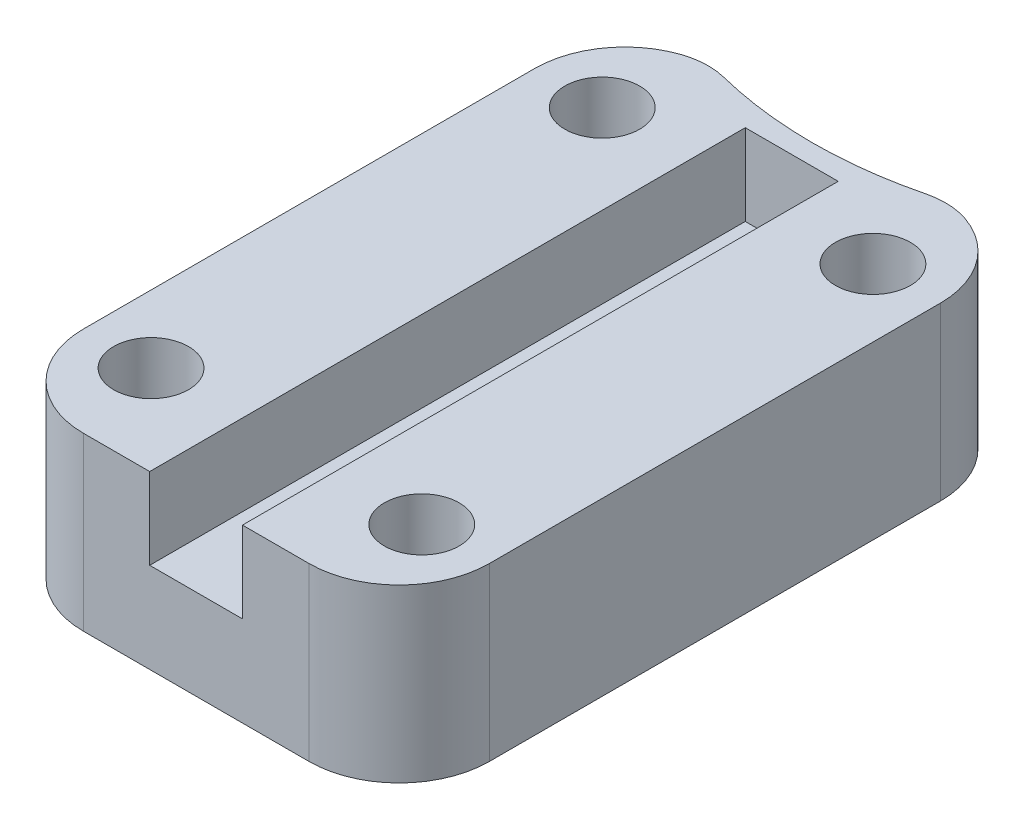
ISO-10303-21;
HEADER;
FILE_DESCRIPTION(('STEP AP214'),'2;1');
FILE_NAME('part.step','',(''),(''),'','','');
FILE_SCHEMA(('AUTOMOTIVE_DESIGN { 1 0 10303 214 1 1 1 1 }'));
ENDSEC;
DATA;
#1=APPLICATION_CONTEXT('core data for automotive mechanical design processes');
#2=APPLICATION_PROTOCOL_DEFINITION('international standard','automotive_design',2000,#1);
#3=PRODUCT_CONTEXT('',#1,'mechanical');
#4=PRODUCT('Part','Part','',(#3));
#5=PRODUCT_RELATED_PRODUCT_CATEGORY('part','',(#4));
#6=PRODUCT_DEFINITION_FORMATION('','',#4);
#7=PRODUCT_DEFINITION_CONTEXT('part definition',#1,'design');
#8=PRODUCT_DEFINITION('design','',#6,#7);
#9=PRODUCT_DEFINITION_SHAPE('','',#8);
#10=(LENGTH_UNIT() NAMED_UNIT(*) SI_UNIT(.MILLI.,.METRE.));
#11=(NAMED_UNIT(*) PLANE_ANGLE_UNIT() SI_UNIT($,.RADIAN.));
#12=(NAMED_UNIT(*) SI_UNIT($,.STERADIAN.) SOLID_ANGLE_UNIT());
#13=UNCERTAINTY_MEASURE_WITH_UNIT(LENGTH_MEASURE(1.E-05),#10,'distance_accuracy_value','');
#14=(GEOMETRIC_REPRESENTATION_CONTEXT(3) GLOBAL_UNCERTAINTY_ASSIGNED_CONTEXT((#13)) GLOBAL_UNIT_ASSIGNED_CONTEXT((#10,
#11,#12)) REPRESENTATION_CONTEXT('',''));
#15=CARTESIAN_POINT('',(0.,0.,0.));
#16=DIRECTION('',(0.,0.,1.));
#17=DIRECTION('',(1.,0.,0.));
#18=AXIS2_PLACEMENT_3D('',#15,#16,#17);
#19=CARTESIAN_POINT('',(-22.5,10.,35.));
#20=DIRECTION('',(1.,0.,0.));
#21=DIRECTION('',(0.,0.,-1.));
#22=AXIS2_PLACEMENT_3D('',#19,#20,#21);
#23=PLANE('',#22);
#24=DIRECTION('',(0.,0.,1.));
#25=VECTOR('',#24,1.);
#26=CARTESIAN_POINT('',(-22.5,0.,35.));
#27=LINE('',#26,#25);
#28=CARTESIAN_POINT('',(-22.5,0.,-25.));
#29=VERTEX_POINT('',#28);
#30=CARTESIAN_POINT('',(-22.5,0.,25.));
#31=VERTEX_POINT('',#30);
#32=EDGE_CURVE('E165',#29,#31,#27,.T.);
#33=ORIENTED_EDGE('',*,*,#32,.T.);
#34=DIRECTION('',(0.,-1.,0.));
#35=VECTOR('',#34,1.);
#36=CARTESIAN_POINT('',(-22.5,10.,25.));
#37=LINE('',#36,#35);
#38=CARTESIAN_POINT('',(-22.5,19.,25.));
#39=VERTEX_POINT('',#38);
#40=EDGE_CURVE('E267',#31,#39,#37,.F.);
#41=ORIENTED_EDGE('',*,*,#40,.T.);
#42=DIRECTION('',(0.,0.,1.));
#43=VECTOR('',#42,1.);
#44=CARTESIAN_POINT('',(-22.5,19.,35.));
#45=LINE('',#44,#43);
#46=CARTESIAN_POINT('',(-22.5,19.,-25.));
#47=VERTEX_POINT('',#46);
#48=EDGE_CURVE('E154',#47,#39,#45,.T.);
#49=ORIENTED_EDGE('',*,*,#48,.F.);
#50=DIRECTION('',(0.,-1.,0.));
#51=VECTOR('',#50,1.);
#52=CARTESIAN_POINT('',(-22.5,10.,-25.));
#53=LINE('',#52,#51);
#54=EDGE_CURVE('E264',#47,#29,#53,.T.);
#55=ORIENTED_EDGE('',*,*,#54,.T.);
#56=EDGE_LOOP('',(#33,#41,#49,#55));
#57=FACE_BOUND('',#56,.T.);
#58=ADVANCED_FACE('F34',(#57),#23,.F.);
#59=CARTESIAN_POINT('',(22.5,10.,35.));
#60=DIRECTION('',(0.,0.,-1.));
#61=DIRECTION('',(-1.,0.,0.));
#62=AXIS2_PLACEMENT_3D('',#59,#60,#61);
#63=PLANE('',#62);
#64=DIRECTION('',(1.,0.,0.));
#65=VECTOR('',#64,1.);
#66=CARTESIAN_POINT('',(22.5,0.,35.));
#67=LINE('',#66,#65);
#68=CARTESIAN_POINT('',(-12.5,0.,35.));
#69=VERTEX_POINT('',#68);
#70=CARTESIAN_POINT('',(12.5,0.,35.));
#71=VERTEX_POINT('',#70);
#72=EDGE_CURVE('E212',#69,#71,#67,.T.);
#73=ORIENTED_EDGE('',*,*,#72,.T.);
#74=DIRECTION('',(0.,-1.,0.));
#75=VECTOR('',#74,1.);
#76=CARTESIAN_POINT('',(12.5,10.,35.));
#77=LINE('',#76,#75);
#78=CARTESIAN_POINT('',(12.5,19.,35.));
#79=VERTEX_POINT('',#78);
#80=EDGE_CURVE('E254',#71,#79,#77,.F.);
#81=ORIENTED_EDGE('',*,*,#80,.T.);
#82=DIRECTION('',(1.,0.,0.));
#83=VECTOR('',#82,1.);
#84=CARTESIAN_POINT('',(5.15,19.,35.));
#85=LINE('',#84,#83);
#86=CARTESIAN_POINT('',(5.15,19.,35.));
#87=VERTEX_POINT('',#86);
#88=EDGE_CURVE('E180',#87,#79,#85,.T.);
#89=ORIENTED_EDGE('',*,*,#88,.F.);
#90=DIRECTION('',(0.,-1.,0.));
#91=VECTOR('',#90,1.);
#92=CARTESIAN_POINT('',(5.15,19.,35.));
#93=LINE('',#92,#91);
#94=CARTESIAN_POINT('',(5.15,10.,35.));
#95=VERTEX_POINT('',#94);
#96=EDGE_CURVE('E186',#87,#95,#93,.T.);
#97=ORIENTED_EDGE('',*,*,#96,.T.);
#98=DIRECTION('',(1.,0.,0.));
#99=VECTOR('',#98,1.);
#100=CARTESIAN_POINT('',(22.5,10.,35.));
#101=LINE('',#100,#99);
#102=CARTESIAN_POINT('',(-5.15,10.,35.));
#103=VERTEX_POINT('',#102);
#104=EDGE_CURVE('E162',#103,#95,#101,.T.);
#105=ORIENTED_EDGE('',*,*,#104,.F.);
#106=DIRECTION('',(0.,-1.,0.));
#107=VECTOR('',#106,1.);
#108=CARTESIAN_POINT('',(-5.15,19.,35.));
#109=LINE('',#108,#107);
#110=CARTESIAN_POINT('',(-5.15,19.,35.));
#111=VERTEX_POINT('',#110);
#112=EDGE_CURVE('E158',#111,#103,#109,.T.);
#113=ORIENTED_EDGE('',*,*,#112,.F.);
#114=DIRECTION('',(1.,0.,0.));
#115=VECTOR('',#114,1.);
#116=CARTESIAN_POINT('',(-5.15,19.,35.));
#117=LINE('',#116,#115);
#118=CARTESIAN_POINT('',(-12.5,19.,35.));
#119=VERTEX_POINT('',#118);
#120=EDGE_CURVE('E140',#119,#111,#117,.T.);
#121=ORIENTED_EDGE('',*,*,#120,.F.);
#122=DIRECTION('',(0.,-1.,0.));
#123=VECTOR('',#122,1.);
#124=CARTESIAN_POINT('',(-12.5,10.,35.));
#125=LINE('',#124,#123);
#126=EDGE_CURVE('E252',#119,#69,#125,.T.);
#127=ORIENTED_EDGE('',*,*,#126,.T.);
#128=EDGE_LOOP('',(#73,#81,#89,#97,#105,#113,#121,#127));
#129=FACE_BOUND('',#128,.T.);
#130=ADVANCED_FACE('F160',(#129),#63,.F.);
#131=CARTESIAN_POINT('',(22.5,10.,35.));
#132=DIRECTION('',(-1.,0.,0.));
#133=DIRECTION('',(0.,0.,1.));
#134=AXIS2_PLACEMENT_3D('',#131,#132,#133);
#135=PLANE('',#134);
#136=DIRECTION('',(0.,0.,-1.));
#137=VECTOR('',#136,1.);
#138=CARTESIAN_POINT('',(22.5,19.,35.));
#139=LINE('',#138,#137);
#140=CARTESIAN_POINT('',(22.5,19.,25.));
#141=VERTEX_POINT('',#140);
#142=CARTESIAN_POINT('',(22.5,19.,-25.));
#143=VERTEX_POINT('',#142);
#144=EDGE_CURVE('E183',#141,#143,#139,.T.);
#145=ORIENTED_EDGE('',*,*,#144,.F.);
#146=DIRECTION('',(0.,-1.,0.));
#147=VECTOR('',#146,1.);
#148=CARTESIAN_POINT('',(22.5,10.,25.));
#149=LINE('',#148,#147);
#150=CARTESIAN_POINT('',(22.5,0.,25.));
#151=VERTEX_POINT('',#150);
#152=EDGE_CURVE('E241',#141,#151,#149,.T.);
#153=ORIENTED_EDGE('',*,*,#152,.T.);
#154=DIRECTION('',(0.,0.,-1.));
#155=VECTOR('',#154,1.);
#156=CARTESIAN_POINT('',(22.5,0.,35.));
#157=LINE('',#156,#155);
#158=CARTESIAN_POINT('',(22.5,0.,-25.));
#159=VERTEX_POINT('',#158);
#160=EDGE_CURVE('E209',#151,#159,#157,.T.);
#161=ORIENTED_EDGE('',*,*,#160,.T.);
#162=DIRECTION('',(0.,-1.,0.));
#163=VECTOR('',#162,1.);
#164=CARTESIAN_POINT('',(22.5,10.,-25.));
#165=LINE('',#164,#163);
#166=EDGE_CURVE('E239',#159,#143,#165,.F.);
#167=ORIENTED_EDGE('',*,*,#166,.T.);
#168=EDGE_LOOP('',(#145,#153,#161,#167));
#169=FACE_BOUND('',#168,.T.);
#170=ADVANCED_FACE('F312',(#169),#135,.F.);
#171=CARTESIAN_POINT('',(0.,10.,0.));
#172=DIRECTION('',(0.,1.,0.));
#173=DIRECTION('',(0.,0.,1.));
#174=AXIS2_PLACEMENT_3D('',#171,#172,#173);
#175=PLANE('',#174);
#176=DIRECTION('',(0.363344208928321,0.,0.93165497145577));
#177=VECTOR('',#176,1.);
#178=CARTESIAN_POINT('',(5.15,10.,35.));
#179=LINE('',#178,#177);
#180=CARTESIAN_POINT('',(5.13022934751461,10.,34.9493058476664));
#181=VERTEX_POINT('',#180);
#182=EDGE_CURVE('E196',#181,#95,#179,.T.);
#183=ORIENTED_EDGE('',*,*,#182,.F.);
#184=DIRECTION('',(-0.000299785590505607,0.,0.999999955064299));
#185=VECTOR('',#184,1.);
#186=CARTESIAN_POINT('',(5.15,10.,-31.));
#187=LINE('',#186,#185);
#188=CARTESIAN_POINT('',(5.15,10.,-31.));
#189=VERTEX_POINT('',#188);
#190=EDGE_CURVE('E193',#189,#181,#187,.T.);
#191=ORIENTED_EDGE('',*,*,#190,.F.);
#192=DIRECTION('',(1.,0.,0.));
#193=VECTOR('',#192,1.);
#194=CARTESIAN_POINT('',(-5.15,10.,-31.));
#195=LINE('',#194,#193);
#196=CARTESIAN_POINT('',(-5.15,10.,-31.));
#197=VERTEX_POINT('',#196);
#198=EDGE_CURVE('E189',#197,#189,#195,.T.);
#199=ORIENTED_EDGE('',*,*,#198,.F.);
#200=DIRECTION('',(0.,0.,-1.));
#201=VECTOR('',#200,1.);
#202=CARTESIAN_POINT('',(-5.15,10.,35.));
#203=LINE('',#202,#201);
#204=EDGE_CURVE('E187',#103,#197,#203,.T.);
#205=ORIENTED_EDGE('',*,*,#204,.F.);
#206=ORIENTED_EDGE('',*,*,#104,.T.);
#207=EDGE_LOOP('',(#183,#191,#199,#205,#206));
#208=FACE_BOUND('',#207,.T.);
#209=ADVANCED_FACE('F394',(#208),#175,.T.);
#210=CARTESIAN_POINT('',(0.,0.,0.));
#211=DIRECTION('',(0.,1.,0.));
#212=DIRECTION('',(0.,0.,1.));
#213=AXIS2_PLACEMENT_3D('',#210,#211,#212);
#214=PLANE('',#213);
#215=CARTESIAN_POINT('',(15.,0.,25.));
#216=DIRECTION('',(0.,1.,0.));
#217=DIRECTION('',(0.,0.,1.));
#218=AXIS2_PLACEMENT_3D('',#215,#216,#217);
#219=CIRCLE('',#218,5.15000000000001);
#220=CARTESIAN_POINT('',(15.,0.,30.15));
#221=VERTEX_POINT('',#220);
#222=EDGE_CURVE('E227',#221,#221,#219,.T.);
#223=ORIENTED_EDGE('',*,*,#222,.T.);
#224=EDGE_LOOP('',(#223));
#225=FACE_BOUND('',#224,.T.);
#226=CARTESIAN_POINT('',(-15.,0.,25.));
#227=DIRECTION('',(0.,1.,0.));
#228=DIRECTION('',(0.,0.,1.));
#229=AXIS2_PLACEMENT_3D('',#226,#227,#228);
#230=CIRCLE('',#229,5.15000000000001);
#231=CARTESIAN_POINT('',(-15.,0.,30.15));
#232=VERTEX_POINT('',#231);
#233=EDGE_CURVE('E224',#232,#232,#230,.T.);
#234=ORIENTED_EDGE('',*,*,#233,.T.);
#235=EDGE_LOOP('',(#234));
#236=FACE_BOUND('',#235,.T.);
#237=CARTESIAN_POINT('',(-15.,0.,-25.));
#238=DIRECTION('',(0.,1.,0.));
#239=DIRECTION('',(0.,0.,1.));
#240=AXIS2_PLACEMENT_3D('',#237,#238,#239);
#241=CIRCLE('',#240,5.15000000000001);
#242=CARTESIAN_POINT('',(-15.,0.,-19.85));
#243=VERTEX_POINT('',#242);
#244=EDGE_CURVE('E221',#243,#243,#241,.T.);
#245=ORIENTED_EDGE('',*,*,#244,.T.);
#246=EDGE_LOOP('',(#245));
#247=FACE_BOUND('',#246,.T.);
#248=CARTESIAN_POINT('',(15.,0.,-25.));
#249=DIRECTION('',(0.,1.,0.));
#250=DIRECTION('',(0.,0.,1.));
#251=AXIS2_PLACEMENT_3D('',#248,#249,#250);
#252=CIRCLE('',#251,5.15000000000001);
#253=CARTESIAN_POINT('',(15.,0.,-19.85));
#254=VERTEX_POINT('',#253);
#255=EDGE_CURVE('E218',#254,#254,#252,.T.);
#256=ORIENTED_EDGE('',*,*,#255,.T.);
#257=EDGE_LOOP('',(#256));
#258=FACE_BOUND('',#257,.T.);
#259=CARTESIAN_POINT('',(-12.5,0.,-25.));
#260=DIRECTION('',(0.,1.,0.));
#261=DIRECTION('',(0.,0.,1.));
#262=AXIS2_PLACEMENT_3D('',#259,#260,#261);
#263=CIRCLE('',#262,10.);
#264=CARTESIAN_POINT('',(-15.7226987115137,0.,-34.46647838506));
#265=VERTEX_POINT('',#264);
#266=EDGE_CURVE('E246',#29,#265,#263,.F.);
#267=ORIENTED_EDGE('',*,*,#266,.T.);
#268=CARTESIAN_POINT('',(-13.1445397423027,0.,-26.893295677012));
#269=DIRECTION('',(0.,1.,0.));
#270=DIRECTION('',(0.,0.,1.));
#271=AXIS2_PLACEMENT_3D('',#268,#269,#270);
#272=CIRCLE('',#271,8.);
#273=CARTESIAN_POINT('',(-11.1972005212208,0.,-34.6526687159911));
#274=VERTEX_POINT('',#273);
#275=EDGE_CURVE('E42',#265,#274,#272,.F.);
#276=ORIENTED_EDGE('',*,*,#275,.T.);
#277=CARTESIAN_POINT('',(0.,0.,-79.2690636901211));
#278=DIRECTION('',(0.,1.,0.));
#279=DIRECTION('',(0.,0.,1.));
#280=AXIS2_PLACEMENT_3D('',#277,#278,#279);
#281=CIRCLE('',#280,46.);
#282=CARTESIAN_POINT('',(11.1972005212208,0.,-34.6526687159911));
#283=VERTEX_POINT('',#282);
#284=EDGE_CURVE('E283',#274,#283,#281,.T.);
#285=ORIENTED_EDGE('',*,*,#284,.T.);
#286=CARTESIAN_POINT('',(13.1445397423027,0.,-26.893295677012));
#287=DIRECTION('',(0.,1.,0.));
#288=DIRECTION('',(0.,0.,1.));
#289=AXIS2_PLACEMENT_3D('',#286,#287,#288);
#290=CIRCLE('',#289,8.);
#291=CARTESIAN_POINT('',(15.7226987115137,0.,-34.46647838506));
#292=VERTEX_POINT('',#291);
#293=EDGE_CURVE('E49',#283,#292,#290,.F.);
#294=ORIENTED_EDGE('',*,*,#293,.T.);
#295=CARTESIAN_POINT('',(12.5,0.,-25.));
#296=DIRECTION('',(0.,1.,0.));
#297=DIRECTION('',(0.,0.,1.));
#298=AXIS2_PLACEMENT_3D('',#295,#296,#297);
#299=CIRCLE('',#298,10.);
#300=EDGE_CURVE('E244',#292,#159,#299,.F.);
#301=ORIENTED_EDGE('',*,*,#300,.T.);
#302=ORIENTED_EDGE('',*,*,#160,.F.);
#303=CARTESIAN_POINT('',(12.5,0.,25.));
#304=DIRECTION('',(0.,1.,0.));
#305=DIRECTION('',(0.,0.,1.));
#306=AXIS2_PLACEMENT_3D('',#303,#304,#305);
#307=CIRCLE('',#306,10.);
#308=EDGE_CURVE('E250',#151,#71,#307,.F.);
#309=ORIENTED_EDGE('',*,*,#308,.T.);
#310=ORIENTED_EDGE('',*,*,#72,.F.);
#311=CARTESIAN_POINT('',(-12.5,0.,25.));
#312=DIRECTION('',(0.,1.,0.));
#313=DIRECTION('',(0.,0.,1.));
#314=AXIS2_PLACEMENT_3D('',#311,#312,#313);
#315=CIRCLE('',#314,10.);
#316=EDGE_CURVE('E248',#69,#31,#315,.F.);
#317=ORIENTED_EDGE('',*,*,#316,.T.);
#318=ORIENTED_EDGE('',*,*,#32,.F.);
#319=EDGE_LOOP('',(#267,#276,#285,#294,#301,#302,#309,#310,#317,#318));
#320=FACE_BOUND('',#319,.T.);
#321=ADVANCED_FACE('F282',(#225,#236,#247,#258,#320),#214,.F.);
#322=CARTESIAN_POINT('',(-15.,10.,-25.));
#323=DIRECTION('',(0.,-1.,0.));
#324=DIRECTION('',(0.,0.,-1.));
#325=AXIS2_PLACEMENT_3D('',#322,#323,#324);
#326=CYLINDRICAL_SURFACE('',#325,4.15);
#327=CARTESIAN_POINT('',(-15.,1.19175359259421,-25.));
#328=DIRECTION('',(0.,1.,0.));
#329=DIRECTION('',(0.,0.,1.));
#330=AXIS2_PLACEMENT_3D('',#327,#328,#329);
#331=CIRCLE('',#330,4.15);
#332=CARTESIAN_POINT('',(-15.,1.19175359259421,-20.85));
#333=VERTEX_POINT('',#332);
#334=EDGE_CURVE('E233',#333,#333,#331,.F.);
#335=ORIENTED_EDGE('',*,*,#334,.T.);
#336=EDGE_LOOP('',(#335));
#337=FACE_BOUND('',#336,.T.);
#338=CARTESIAN_POINT('',(-15.,19.,-25.));
#339=DIRECTION('',(0.,1.,0.));
#340=DIRECTION('',(0.,0.,1.));
#341=AXIS2_PLACEMENT_3D('',#338,#339,#340);
#342=CIRCLE('',#341,4.15);
#343=CARTESIAN_POINT('',(-15.,19.,-20.85));
#344=VERTEX_POINT('',#343);
#345=EDGE_CURVE('E190',#344,#344,#342,.T.);
#346=ORIENTED_EDGE('',*,*,#345,.T.);
#347=EDGE_LOOP('',(#346));
#348=FACE_BOUND('',#347,.T.);
#349=ADVANCED_FACE('F389',(#337,#348),#326,.F.);
#350=CARTESIAN_POINT('',(15.,10.,-25.));
#351=DIRECTION('',(0.,-1.,0.));
#352=DIRECTION('',(0.,0.,-1.));
#353=AXIS2_PLACEMENT_3D('',#350,#351,#352);
#354=CYLINDRICAL_SURFACE('',#353,4.15);
#355=CARTESIAN_POINT('',(15.,1.19175359259421,-25.));
#356=DIRECTION('',(0.,1.,0.));
#357=DIRECTION('',(0.,0.,1.));
#358=AXIS2_PLACEMENT_3D('',#355,#356,#357);
#359=CIRCLE('',#358,4.15);
#360=CARTESIAN_POINT('',(15.,1.19175359259421,-20.85));
#361=VERTEX_POINT('',#360);
#362=EDGE_CURVE('E236',#361,#361,#359,.F.);
#363=ORIENTED_EDGE('',*,*,#362,.T.);
#364=EDGE_LOOP('',(#363));
#365=FACE_BOUND('',#364,.T.);
#366=CARTESIAN_POINT('',(15.,19.,-25.));
#367=DIRECTION('',(0.,1.,0.));
#368=DIRECTION('',(0.,0.,1.));
#369=AXIS2_PLACEMENT_3D('',#366,#367,#368);
#370=CIRCLE('',#369,4.15);
#371=CARTESIAN_POINT('',(15.,19.,-20.85));
#372=VERTEX_POINT('',#371);
#373=EDGE_CURVE('E582',#372,#372,#370,.T.);
#374=ORIENTED_EDGE('',*,*,#373,.T.);
#375=EDGE_LOOP('',(#374));
#376=FACE_BOUND('',#375,.T.);
#377=ADVANCED_FACE('F385',(#365,#376),#354,.F.);
#378=CARTESIAN_POINT('',(15.,10.,25.));
#379=DIRECTION('',(0.,-1.,0.));
#380=DIRECTION('',(0.,0.,-1.));
#381=AXIS2_PLACEMENT_3D('',#378,#379,#380);
#382=CYLINDRICAL_SURFACE('',#381,4.15);
#383=CARTESIAN_POINT('',(15.,1.19175359259421,25.));
#384=DIRECTION('',(0.,1.,0.));
#385=DIRECTION('',(0.,0.,1.));
#386=AXIS2_PLACEMENT_3D('',#383,#384,#385);
#387=CIRCLE('',#386,4.15);
#388=CARTESIAN_POINT('',(15.,1.19175359259421,29.15));
#389=VERTEX_POINT('',#388);
#390=EDGE_CURVE('E208',#389,#389,#387,.F.);
#391=ORIENTED_EDGE('',*,*,#390,.T.);
#392=EDGE_LOOP('',(#391));
#393=FACE_BOUND('',#392,.T.);
#394=CARTESIAN_POINT('',(15.,19.,25.));
#395=DIRECTION('',(0.,1.,0.));
#396=DIRECTION('',(0.,0.,1.));
#397=AXIS2_PLACEMENT_3D('',#394,#395,#396);
#398=CIRCLE('',#397,4.15);
#399=CARTESIAN_POINT('',(15.,19.,29.15));
#400=VERTEX_POINT('',#399);
#401=EDGE_CURVE('E584',#400,#400,#398,.T.);
#402=ORIENTED_EDGE('',*,*,#401,.T.);
#403=EDGE_LOOP('',(#402));
#404=FACE_BOUND('',#403,.T.);
#405=ADVANCED_FACE('F381',(#393,#404),#382,.F.);
#406=CARTESIAN_POINT('',(-15.,10.,25.));
#407=DIRECTION('',(0.,-1.,0.));
#408=DIRECTION('',(0.,0.,-1.));
#409=AXIS2_PLACEMENT_3D('',#406,#407,#408);
#410=CYLINDRICAL_SURFACE('',#409,4.15);
#411=CARTESIAN_POINT('',(-15.,1.19175359259421,25.));
#412=DIRECTION('',(0.,1.,0.));
#413=DIRECTION('',(0.,0.,1.));
#414=AXIS2_PLACEMENT_3D('',#411,#412,#413);
#415=CIRCLE('',#414,4.15);
#416=CARTESIAN_POINT('',(-15.,1.19175359259421,29.15));
#417=VERTEX_POINT('',#416);
#418=EDGE_CURVE('E230',#417,#417,#415,.F.);
#419=ORIENTED_EDGE('',*,*,#418,.T.);
#420=EDGE_LOOP('',(#419));
#421=FACE_BOUND('',#420,.T.);
#422=CARTESIAN_POINT('',(-15.,19.,25.));
#423=DIRECTION('',(0.,1.,0.));
#424=DIRECTION('',(0.,0.,1.));
#425=AXIS2_PLACEMENT_3D('',#422,#423,#424);
#426=CIRCLE('',#425,4.15);
#427=CARTESIAN_POINT('',(-15.,19.,29.15));
#428=VERTEX_POINT('',#427);
#429=EDGE_CURVE('E291',#428,#428,#426,.T.);
#430=ORIENTED_EDGE('',*,*,#429,.T.);
#431=EDGE_LOOP('',(#430));
#432=FACE_BOUND('',#431,.T.);
#433=ADVANCED_FACE('F365',(#421,#432),#410,.F.);
#434=CARTESIAN_POINT('',(0.,19.,0.));
#435=DIRECTION('',(0.,1.,0.));
#436=DIRECTION('',(0.,0.,1.));
#437=AXIS2_PLACEMENT_3D('',#434,#435,#436);
#438=PLANE('',#437);
#439=CARTESIAN_POINT('',(0.,19.,-79.2690636901211));
#440=DIRECTION('',(0.,1.,0.));
#441=DIRECTION('',(0.,0.,1.));
#442=AXIS2_PLACEMENT_3D('',#439,#440,#441);
#443=CIRCLE('',#442,46.);
#444=CARTESIAN_POINT('',(-11.1972005212208,19.,-34.6526687159911));
#445=VERTEX_POINT('',#444);
#446=CARTESIAN_POINT('',(11.1972005212208,19.,-34.6526687159911));
#447=VERTEX_POINT('',#446);
#448=EDGE_CURVE('E292',#445,#447,#443,.T.);
#449=ORIENTED_EDGE('',*,*,#448,.F.);
#450=CARTESIAN_POINT('',(-13.1445397423027,19.,-26.893295677012));
#451=DIRECTION('',(0.,1.,0.));
#452=DIRECTION('',(0.,0.,1.));
#453=AXIS2_PLACEMENT_3D('',#450,#451,#452);
#454=CIRCLE('',#453,8.);
#455=CARTESIAN_POINT('',(-15.7226987115137,19.,-34.46647838506));
#456=VERTEX_POINT('',#455);
#457=EDGE_CURVE('E277',#445,#456,#454,.T.);
#458=ORIENTED_EDGE('',*,*,#457,.T.);
#459=CARTESIAN_POINT('',(-12.5,19.,-25.));
#460=DIRECTION('',(0.,1.,0.));
#461=DIRECTION('',(0.,0.,1.));
#462=AXIS2_PLACEMENT_3D('',#459,#460,#461);
#463=CIRCLE('',#462,10.);
#464=EDGE_CURVE('E259',#456,#47,#463,.T.);
#465=ORIENTED_EDGE('',*,*,#464,.T.);
#466=ORIENTED_EDGE('',*,*,#48,.T.);
#467=CARTESIAN_POINT('',(-12.5,19.,25.));
#468=DIRECTION('',(0.,1.,0.));
#469=DIRECTION('',(0.,0.,1.));
#470=AXIS2_PLACEMENT_3D('',#467,#468,#469);
#471=CIRCLE('',#470,10.);
#472=EDGE_CURVE('E150',#39,#119,#471,.T.);
#473=ORIENTED_EDGE('',*,*,#472,.T.);
#474=ORIENTED_EDGE('',*,*,#120,.T.);
#475=DIRECTION('',(0.,0.,-1.));
#476=VECTOR('',#475,1.);
#477=CARTESIAN_POINT('',(-5.15,19.,35.));
#478=LINE('',#477,#476);
#479=CARTESIAN_POINT('',(-5.15,19.,-31.));
#480=VERTEX_POINT('',#479);
#481=EDGE_CURVE('E146',#111,#480,#478,.T.);
#482=ORIENTED_EDGE('',*,*,#481,.T.);
#483=DIRECTION('',(1.,0.,0.));
#484=VECTOR('',#483,1.);
#485=CARTESIAN_POINT('',(-5.15,19.,-31.));
#486=LINE('',#485,#484);
#487=CARTESIAN_POINT('',(5.15,19.,-31.));
#488=VERTEX_POINT('',#487);
#489=EDGE_CURVE('E171',#480,#488,#486,.T.);
#490=ORIENTED_EDGE('',*,*,#489,.T.);
#491=DIRECTION('',(-0.000299785590505607,0.,0.999999955064299));
#492=VECTOR('',#491,1.);
#493=CARTESIAN_POINT('',(5.15,19.,-31.));
#494=LINE('',#493,#492);
#495=CARTESIAN_POINT('',(5.13022934751461,19.,34.9493058476664));
#496=VERTEX_POINT('',#495);
#497=EDGE_CURVE('E173',#488,#496,#494,.T.);
#498=ORIENTED_EDGE('',*,*,#497,.T.);
#499=DIRECTION('',(0.363344208928321,0.,0.93165497145577));
#500=VECTOR('',#499,1.);
#501=CARTESIAN_POINT('',(5.15,19.,35.));
#502=LINE('',#501,#500);
#503=EDGE_CURVE('E178',#496,#87,#502,.T.);
#504=ORIENTED_EDGE('',*,*,#503,.T.);
#505=ORIENTED_EDGE('',*,*,#88,.T.);
#506=CARTESIAN_POINT('',(12.5,19.,25.));
#507=DIRECTION('',(0.,1.,0.));
#508=DIRECTION('',(0.,0.,1.));
#509=AXIS2_PLACEMENT_3D('',#506,#507,#508);
#510=CIRCLE('',#509,10.);
#511=EDGE_CURVE('E262',#79,#141,#510,.T.);
#512=ORIENTED_EDGE('',*,*,#511,.T.);
#513=ORIENTED_EDGE('',*,*,#144,.T.);
#514=CARTESIAN_POINT('',(12.5,19.,-25.));
#515=DIRECTION('',(0.,1.,0.));
#516=DIRECTION('',(0.,0.,1.));
#517=AXIS2_PLACEMENT_3D('',#514,#515,#516);
#518=CIRCLE('',#517,10.);
#519=CARTESIAN_POINT('',(15.7226987115137,19.,-34.46647838506));
#520=VERTEX_POINT('',#519);
#521=EDGE_CURVE('E256',#143,#520,#518,.T.);
#522=ORIENTED_EDGE('',*,*,#521,.T.);
#523=CARTESIAN_POINT('',(13.1445397423027,19.,-26.893295677012));
#524=DIRECTION('',(0.,1.,0.));
#525=DIRECTION('',(0.,0.,1.));
#526=AXIS2_PLACEMENT_3D('',#523,#524,#525);
#527=CIRCLE('',#526,8.);
#528=EDGE_CURVE('E275',#520,#447,#527,.T.);
#529=ORIENTED_EDGE('',*,*,#528,.T.);
#530=EDGE_LOOP('',(#449,#458,#465,#466,#473,#474,#482,#490,#498,#504,#505,#512,#513,#522,#529));
#531=FACE_BOUND('',#530,.T.);
#532=ORIENTED_EDGE('',*,*,#401,.F.);
#533=EDGE_LOOP('',(#532));
#534=FACE_BOUND('',#533,.T.);
#535=ORIENTED_EDGE('',*,*,#345,.F.);
#536=EDGE_LOOP('',(#535));
#537=FACE_BOUND('',#536,.T.);
#538=ORIENTED_EDGE('',*,*,#373,.F.);
#539=EDGE_LOOP('',(#538));
#540=FACE_BOUND('',#539,.T.);
#541=ORIENTED_EDGE('',*,*,#429,.F.);
#542=EDGE_LOOP('',(#541));
#543=FACE_BOUND('',#542,.T.);
#544=ADVANCED_FACE('F143',(#531,#534,#537,#540,#543),#438,.T.);
#545=CARTESIAN_POINT('',(-5.15,19.,35.));
#546=DIRECTION('',(-1.,0.,0.));
#547=DIRECTION('',(0.,0.,1.));
#548=AXIS2_PLACEMENT_3D('',#545,#546,#547);
#549=PLANE('',#548);
#550=ORIENTED_EDGE('',*,*,#204,.T.);
#551=DIRECTION('',(0.,-1.,0.));
#552=VECTOR('',#551,1.);
#553=CARTESIAN_POINT('',(-5.15,19.,-31.));
#554=LINE('',#553,#552);
#555=EDGE_CURVE('E166',#480,#197,#554,.T.);
#556=ORIENTED_EDGE('',*,*,#555,.F.);
#557=ORIENTED_EDGE('',*,*,#481,.F.);
#558=ORIENTED_EDGE('',*,*,#112,.T.);
#559=EDGE_LOOP('',(#550,#556,#557,#558));
#560=FACE_BOUND('',#559,.T.);
#561=ADVANCED_FACE('F168',(#560),#549,.F.);
#562=CARTESIAN_POINT('',(-5.15,19.,-31.));
#563=DIRECTION('',(0.,0.,-1.));
#564=DIRECTION('',(-1.,0.,0.));
#565=AXIS2_PLACEMENT_3D('',#562,#563,#564);
#566=PLANE('',#565);
#567=ORIENTED_EDGE('',*,*,#198,.T.);
#568=DIRECTION('',(0.,-1.,0.));
#569=VECTOR('',#568,1.);
#570=CARTESIAN_POINT('',(5.15,19.,-31.));
#571=LINE('',#570,#569);
#572=EDGE_CURVE('E203',#488,#189,#571,.T.);
#573=ORIENTED_EDGE('',*,*,#572,.F.);
#574=ORIENTED_EDGE('',*,*,#489,.F.);
#575=ORIENTED_EDGE('',*,*,#555,.T.);
#576=EDGE_LOOP('',(#567,#573,#574,#575));
#577=FACE_BOUND('',#576,.T.);
#578=ADVANCED_FACE('F372',(#577),#566,.F.);
#579=CARTESIAN_POINT('',(5.15,19.,-31.));
#580=DIRECTION('',(0.999999955064299,0.,0.000299785590505607));
#581=DIRECTION('',(0.000299785590505607,0.,-0.999999955064299));
#582=AXIS2_PLACEMENT_3D('',#579,#580,#581);
#583=PLANE('',#582);
#584=ORIENTED_EDGE('',*,*,#190,.T.);
#585=DIRECTION('',(0.,-1.,0.));
#586=VECTOR('',#585,1.);
#587=CARTESIAN_POINT('',(5.13022934751461,19.,34.9493058476664));
#588=LINE('',#587,#586);
#589=EDGE_CURVE('E200',#496,#181,#588,.T.);
#590=ORIENTED_EDGE('',*,*,#589,.F.);
#591=ORIENTED_EDGE('',*,*,#497,.F.);
#592=ORIENTED_EDGE('',*,*,#572,.T.);
#593=EDGE_LOOP('',(#584,#590,#591,#592));
#594=FACE_BOUND('',#593,.T.);
#595=ADVANCED_FACE('F368',(#594),#583,.F.);
#596=CARTESIAN_POINT('',(5.15,19.,35.));
#597=DIRECTION('',(0.931654971455771,0.,-0.363344208928321));
#598=DIRECTION('',(-0.363344208928321,0.,-0.931654971455771));
#599=AXIS2_PLACEMENT_3D('',#596,#597,#598);
#600=PLANE('',#599);
#601=ORIENTED_EDGE('',*,*,#182,.T.);
#602=ORIENTED_EDGE('',*,*,#96,.F.);
#603=ORIENTED_EDGE('',*,*,#503,.F.);
#604=ORIENTED_EDGE('',*,*,#589,.T.);
#605=EDGE_LOOP('',(#601,#602,#603,#604));
#606=FACE_BOUND('',#605,.T.);
#607=ADVANCED_FACE('F336',(#606),#600,.F.);
#608=CARTESIAN_POINT('',(15.,1.19175359259421,25.));
#609=DIRECTION('',(0.,-1.,0.));
#610=DIRECTION('',(0.,0.,-1.));
#611=AXIS2_PLACEMENT_3D('',#608,#609,#610);
#612=CONICAL_SURFACE('',#611,4.15,0.698131700797736);
#613=ORIENTED_EDGE('',*,*,#222,.F.);
#614=EDGE_LOOP('',(#613));
#615=FACE_BOUND('',#614,.T.);
#616=ORIENTED_EDGE('',*,*,#390,.F.);
#617=EDGE_LOOP('',(#616));
#618=FACE_BOUND('',#617,.T.);
#619=ADVANCED_FACE('F332',(#615,#618),#612,.F.);
#620=CARTESIAN_POINT('',(-15.,1.19175359259421,25.));
#621=DIRECTION('',(0.,-1.,0.));
#622=DIRECTION('',(0.,0.,-1.));
#623=AXIS2_PLACEMENT_3D('',#620,#621,#622);
#624=CONICAL_SURFACE('',#623,4.15,0.698131700797736);
#625=ORIENTED_EDGE('',*,*,#233,.F.);
#626=EDGE_LOOP('',(#625));
#627=FACE_BOUND('',#626,.T.);
#628=ORIENTED_EDGE('',*,*,#418,.F.);
#629=EDGE_LOOP('',(#628));
#630=FACE_BOUND('',#629,.T.);
#631=ADVANCED_FACE('F335',(#627,#630),#624,.F.);
#632=CARTESIAN_POINT('',(-15.,1.19175359259421,-25.));
#633=DIRECTION('',(0.,-1.,0.));
#634=DIRECTION('',(0.,0.,-1.));
#635=AXIS2_PLACEMENT_3D('',#632,#633,#634);
#636=CONICAL_SURFACE('',#635,4.15,0.698131700797736);
#637=ORIENTED_EDGE('',*,*,#244,.F.);
#638=EDGE_LOOP('',(#637));
#639=FACE_BOUND('',#638,.T.);
#640=ORIENTED_EDGE('',*,*,#334,.F.);
#641=EDGE_LOOP('',(#640));
#642=FACE_BOUND('',#641,.T.);
#643=ADVANCED_FACE('F340',(#639,#642),#636,.F.);
#644=CARTESIAN_POINT('',(15.,1.19175359259421,-25.));
#645=DIRECTION('',(0.,-1.,0.));
#646=DIRECTION('',(0.,0.,-1.));
#647=AXIS2_PLACEMENT_3D('',#644,#645,#646);
#648=CONICAL_SURFACE('',#647,4.15,0.698131700797735);
#649=ORIENTED_EDGE('',*,*,#255,.F.);
#650=EDGE_LOOP('',(#649));
#651=FACE_BOUND('',#650,.T.);
#652=ORIENTED_EDGE('',*,*,#362,.F.);
#653=EDGE_LOOP('',(#652));
#654=FACE_BOUND('',#653,.T.);
#655=ADVANCED_FACE('F344',(#651,#654),#648,.F.);
#656=CARTESIAN_POINT('',(12.5,10.,25.));
#657=DIRECTION('',(0.,-1.,0.));
#658=DIRECTION('',(0.,0.,-1.));
#659=AXIS2_PLACEMENT_3D('',#656,#657,#658);
#660=CYLINDRICAL_SURFACE('',#659,10.);
#661=ORIENTED_EDGE('',*,*,#511,.F.);
#662=ORIENTED_EDGE('',*,*,#80,.F.);
#663=ORIENTED_EDGE('',*,*,#308,.F.);
#664=ORIENTED_EDGE('',*,*,#152,.F.);
#665=EDGE_LOOP('',(#661,#662,#663,#664));
#666=FACE_BOUND('',#665,.T.);
#667=ADVANCED_FACE('F307',(#666),#660,.T.);
#668=CARTESIAN_POINT('',(-12.5,10.,25.));
#669=DIRECTION('',(0.,-1.,0.));
#670=DIRECTION('',(0.,0.,-1.));
#671=AXIS2_PLACEMENT_3D('',#668,#669,#670);
#672=CYLINDRICAL_SURFACE('',#671,10.);
#673=ORIENTED_EDGE('',*,*,#472,.F.);
#674=ORIENTED_EDGE('',*,*,#40,.F.);
#675=ORIENTED_EDGE('',*,*,#316,.F.);
#676=ORIENTED_EDGE('',*,*,#126,.F.);
#677=EDGE_LOOP('',(#673,#674,#675,#676));
#678=FACE_BOUND('',#677,.T.);
#679=ADVANCED_FACE('F302',(#678),#672,.T.);
#680=CARTESIAN_POINT('',(-12.5,10.,-25.));
#681=DIRECTION('',(0.,-1.,0.));
#682=DIRECTION('',(0.,0.,-1.));
#683=AXIS2_PLACEMENT_3D('',#680,#681,#682);
#684=CYLINDRICAL_SURFACE('',#683,10.);
#685=ORIENTED_EDGE('',*,*,#464,.F.);
#686=DIRECTION('',(0.,-1.,0.));
#687=VECTOR('',#686,1.);
#688=CARTESIAN_POINT('',(-15.7226987115137,10.,-34.46647838506));
#689=LINE('',#688,#687);
#690=EDGE_CURVE('E57',#456,#265,#689,.T.);
#691=ORIENTED_EDGE('',*,*,#690,.T.);
#692=ORIENTED_EDGE('',*,*,#266,.F.);
#693=ORIENTED_EDGE('',*,*,#54,.F.);
#694=EDGE_LOOP('',(#685,#691,#692,#693));
#695=FACE_BOUND('',#694,.T.);
#696=ADVANCED_FACE('F297',(#695),#684,.T.);
#697=CARTESIAN_POINT('',(12.5,10.,-25.));
#698=DIRECTION('',(0.,-1.,0.));
#699=DIRECTION('',(0.,0.,-1.));
#700=AXIS2_PLACEMENT_3D('',#697,#698,#699);
#701=CYLINDRICAL_SURFACE('',#700,10.);
#702=ORIENTED_EDGE('',*,*,#300,.F.);
#703=DIRECTION('',(0.,-1.,0.));
#704=VECTOR('',#703,1.);
#705=CARTESIAN_POINT('',(15.7226987115137,10.,-34.46647838506));
#706=LINE('',#705,#704);
#707=EDGE_CURVE('E11',#292,#520,#706,.F.);
#708=ORIENTED_EDGE('',*,*,#707,.T.);
#709=ORIENTED_EDGE('',*,*,#521,.F.);
#710=ORIENTED_EDGE('',*,*,#166,.F.);
#711=EDGE_LOOP('',(#702,#708,#709,#710));
#712=FACE_BOUND('',#711,.T.);
#713=ADVANCED_FACE('F316',(#712),#701,.T.);
#714=CARTESIAN_POINT('',(0.,0.,-79.2690636901211));
#715=DIRECTION('',(0.,1.,0.));
#716=DIRECTION('',(0.,0.,1.));
#717=AXIS2_PLACEMENT_3D('',#714,#715,#716);
#718=CYLINDRICAL_SURFACE('',#717,46.);
#719=ORIENTED_EDGE('',*,*,#284,.F.);
#720=DIRECTION('',(0.,1.,0.));
#721=VECTOR('',#720,1.);
#722=CARTESIAN_POINT('',(-11.1972005212208,0.,-34.6526687159911));
#723=LINE('',#722,#721);
#724=EDGE_CURVE('E272',#274,#445,#723,.T.);
#725=ORIENTED_EDGE('',*,*,#724,.T.);
#726=ORIENTED_EDGE('',*,*,#448,.T.);
#727=DIRECTION('',(0.,1.,0.));
#728=VECTOR('',#727,1.);
#729=CARTESIAN_POINT('',(11.1972005212208,0.,-34.6526687159911));
#730=LINE('',#729,#728);
#731=EDGE_CURVE('E269',#447,#283,#730,.F.);
#732=ORIENTED_EDGE('',*,*,#731,.T.);
#733=EDGE_LOOP('',(#719,#725,#726,#732));
#734=FACE_BOUND('',#733,.T.);
#735=ADVANCED_FACE('F288',(#734),#718,.F.);
#736=CARTESIAN_POINT('',(-13.1445397423027,10.,-26.893295677012));
#737=DIRECTION('',(0.,-1.,0.));
#738=DIRECTION('',(0.,0.,-1.));
#739=AXIS2_PLACEMENT_3D('',#736,#737,#738);
#740=CYLINDRICAL_SURFACE('',#739,8.);
#741=ORIENTED_EDGE('',*,*,#275,.F.);
#742=ORIENTED_EDGE('',*,*,#690,.F.);
#743=ORIENTED_EDGE('',*,*,#457,.F.);
#744=ORIENTED_EDGE('',*,*,#724,.F.);
#745=EDGE_LOOP('',(#741,#742,#743,#744));
#746=FACE_BOUND('',#745,.T.);
#747=ADVANCED_FACE('F294',(#746),#740,.T.);
#748=CARTESIAN_POINT('',(13.1445397423027,10.,-26.893295677012));
#749=DIRECTION('',(0.,1.,0.));
#750=DIRECTION('',(0.,0.,1.));
#751=AXIS2_PLACEMENT_3D('',#748,#749,#750);
#752=CYLINDRICAL_SURFACE('',#751,8.);
#753=ORIENTED_EDGE('',*,*,#528,.F.);
#754=ORIENTED_EDGE('',*,*,#707,.F.);
#755=ORIENTED_EDGE('',*,*,#293,.F.);
#756=ORIENTED_EDGE('',*,*,#731,.F.);
#757=EDGE_LOOP('',(#753,#754,#755,#756));
#758=FACE_BOUND('',#757,.T.);
#759=ADVANCED_FACE('F36',(#758),#752,.T.);
#760=CLOSED_SHELL('',(#58,#130,#170,#209,#321,#349,#377,#405,#433,#544,#561,#578,#595,#607,#619,
#631,#643,#655,#667,#679,#696,#713,#735,#747,#759));
#761=MANIFOLD_SOLID_BREP('B2',#760);
#762=ADVANCED_BREP_SHAPE_REPRESENTATION('',(#18,#761),#14);
#763=SHAPE_DEFINITION_REPRESENTATION(#9,#762);
ENDSEC;
END-ISO-10303-21;
